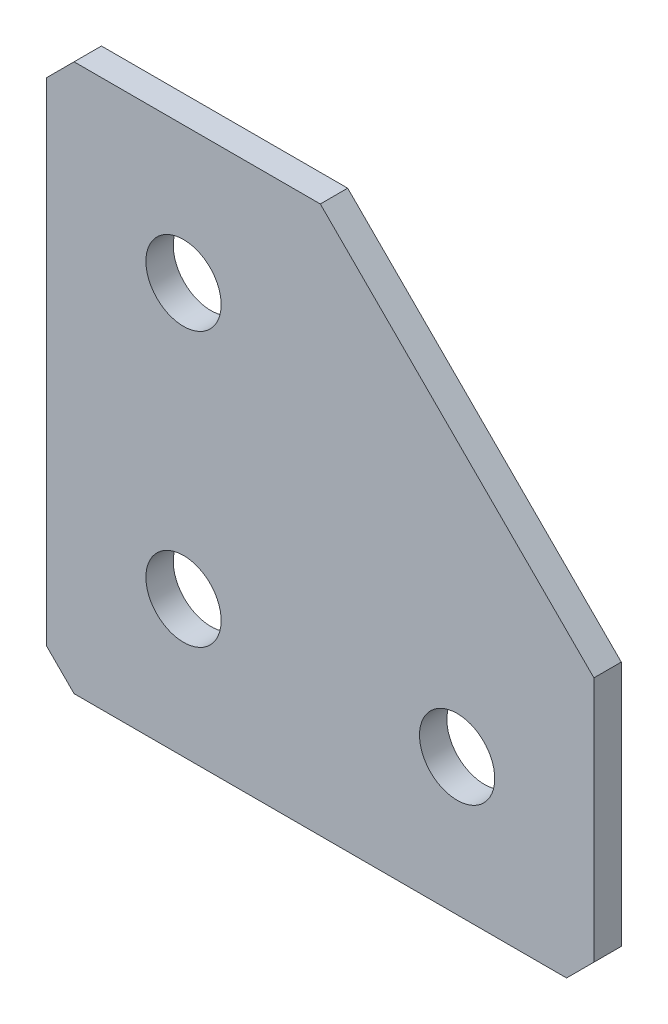
ISO-10303-21;
HEADER;
FILE_DESCRIPTION(('STEP AP214'),'2;1');
FILE_NAME('part.step','',(''),(''),'','','');
FILE_SCHEMA(('AUTOMOTIVE_DESIGN { 1 0 10303 214 1 1 1 1 }'));
ENDSEC;
DATA;
#1=APPLICATION_CONTEXT('core data for automotive mechanical design processes');
#2=APPLICATION_PROTOCOL_DEFINITION('international standard','automotive_design',2000,#1);
#3=PRODUCT_CONTEXT('',#1,'mechanical');
#4=PRODUCT('Part','Part','',(#3));
#5=PRODUCT_RELATED_PRODUCT_CATEGORY('part','',(#4));
#6=PRODUCT_DEFINITION_FORMATION('','',#4);
#7=PRODUCT_DEFINITION_CONTEXT('part definition',#1,'design');
#8=PRODUCT_DEFINITION('design','',#6,#7);
#9=PRODUCT_DEFINITION_SHAPE('','',#8);
#10=(LENGTH_UNIT() NAMED_UNIT(*) SI_UNIT(.MILLI.,.METRE.));
#11=(NAMED_UNIT(*) PLANE_ANGLE_UNIT() SI_UNIT($,.RADIAN.));
#12=(NAMED_UNIT(*) SI_UNIT($,.STERADIAN.) SOLID_ANGLE_UNIT());
#13=UNCERTAINTY_MEASURE_WITH_UNIT(LENGTH_MEASURE(1.E-05),#10,'distance_accuracy_value','');
#14=(GEOMETRIC_REPRESENTATION_CONTEXT(3) GLOBAL_UNCERTAINTY_ASSIGNED_CONTEXT((#13)) GLOBAL_UNIT_ASSIGNED_CONTEXT((#10,
#11,#12)) REPRESENTATION_CONTEXT('',''));
#15=CARTESIAN_POINT('',(0.,0.,0.));
#16=DIRECTION('',(0.,0.,1.));
#17=DIRECTION('',(1.,0.,0.));
#18=AXIS2_PLACEMENT_3D('',#15,#16,#17);
#19=CARTESIAN_POINT('',(20.,0.,-2.));
#20=DIRECTION('',(0.,-1.,0.));
#21=DIRECTION('',(1.,0.,0.));
#22=AXIS2_PLACEMENT_3D('',#19,#20,#21);
#23=PLANE('',#22);
#24=DIRECTION('',(1.,0.,0.));
#25=VECTOR('',#24,1.);
#26=CARTESIAN_POINT('',(20.,0.,-2.));
#27=LINE('',#26,#25);
#28=CARTESIAN_POINT('',(2.,0.,-2.));
#29=VERTEX_POINT('',#28);
#30=CARTESIAN_POINT('',(20.,0.,-2.));
#31=VERTEX_POINT('',#30);
#32=EDGE_CURVE('E103',#29,#31,#27,.T.);
#33=ORIENTED_EDGE('',*,*,#32,.F.);
#34=DIRECTION('',(0.,0.,1.));
#35=VECTOR('',#34,1.);
#36=CARTESIAN_POINT('',(2.,0.,-2.));
#37=LINE('',#36,#35);
#38=CARTESIAN_POINT('',(2.,0.,0.));
#39=VERTEX_POINT('',#38);
#40=EDGE_CURVE('E129',#29,#39,#37,.T.);
#41=ORIENTED_EDGE('',*,*,#40,.T.);
#42=DIRECTION('',(1.,0.,0.));
#43=VECTOR('',#42,1.);
#44=CARTESIAN_POINT('',(20.,0.,0.));
#45=LINE('',#44,#43);
#46=CARTESIAN_POINT('',(20.,0.,0.));
#47=VERTEX_POINT('',#46);
#48=EDGE_CURVE('E127',#39,#47,#45,.T.);
#49=ORIENTED_EDGE('',*,*,#48,.T.);
#50=DIRECTION('',(0.,0.,1.));
#51=VECTOR('',#50,1.);
#52=CARTESIAN_POINT('',(20.,0.,-2.));
#53=LINE('',#52,#51);
#54=EDGE_CURVE('E120',#31,#47,#53,.T.);
#55=ORIENTED_EDGE('',*,*,#54,.F.);
#56=EDGE_LOOP('',(#33,#41,#49,#55));
#57=FACE_BOUND('',#56,.T.);
#58=ADVANCED_FACE('F39',(#57),#23,.F.);
#59=CARTESIAN_POINT('',(40.,-20.,-2.));
#60=DIRECTION('',(-0.707106781186548,-0.707106781186547,0.));
#61=DIRECTION('',(0.707106781186547,-0.707106781186548,0.));
#62=AXIS2_PLACEMENT_3D('',#59,#60,#61);
#63=PLANE('',#62);
#64=DIRECTION('',(0.707106781186547,-0.707106781186548,0.));
#65=VECTOR('',#64,1.);
#66=CARTESIAN_POINT('',(40.,-20.,0.));
#67=LINE('',#66,#65);
#68=CARTESIAN_POINT('',(40.,-20.,0.));
#69=VERTEX_POINT('',#68);
#70=EDGE_CURVE('E166',#47,#69,#67,.T.);
#71=ORIENTED_EDGE('',*,*,#70,.T.);
#72=DIRECTION('',(0.,0.,1.));
#73=VECTOR('',#72,1.);
#74=CARTESIAN_POINT('',(40.,-20.,-2.));
#75=LINE('',#74,#73);
#76=CARTESIAN_POINT('',(40.,-20.,-2.));
#77=VERTEX_POINT('',#76);
#78=EDGE_CURVE('E122',#77,#69,#75,.T.);
#79=ORIENTED_EDGE('',*,*,#78,.F.);
#80=DIRECTION('',(0.707106781186547,-0.707106781186548,0.));
#81=VECTOR('',#80,1.);
#82=CARTESIAN_POINT('',(40.,-20.,-2.));
#83=LINE('',#82,#81);
#84=EDGE_CURVE('E107',#31,#77,#83,.T.);
#85=ORIENTED_EDGE('',*,*,#84,.F.);
#86=ORIENTED_EDGE('',*,*,#54,.T.);
#87=EDGE_LOOP('',(#71,#79,#85,#86));
#88=FACE_BOUND('',#87,.T.);
#89=ADVANCED_FACE('F119',(#88),#63,.F.);
#90=CARTESIAN_POINT('',(40.,-40.,-2.));
#91=DIRECTION('',(-1.,0.,0.));
#92=DIRECTION('',(0.,0.,1.));
#93=AXIS2_PLACEMENT_3D('',#90,#91,#92);
#94=PLANE('',#93);
#95=DIRECTION('',(0.,-1.,0.));
#96=VECTOR('',#95,1.);
#97=CARTESIAN_POINT('',(40.,-40.,0.));
#98=LINE('',#97,#96);
#99=CARTESIAN_POINT('',(40.,-38.,0.));
#100=VERTEX_POINT('',#99);
#101=EDGE_CURVE('E163',#69,#100,#98,.T.);
#102=ORIENTED_EDGE('',*,*,#101,.T.);
#103=DIRECTION('',(0.,0.,-1.));
#104=VECTOR('',#103,1.);
#105=CARTESIAN_POINT('',(40.,-38.,-2.));
#106=LINE('',#105,#104);
#107=CARTESIAN_POINT('',(40.,-38.,-2.));
#108=VERTEX_POINT('',#107);
#109=EDGE_CURVE('E12',#100,#108,#106,.T.);
#110=ORIENTED_EDGE('',*,*,#109,.T.);
#111=DIRECTION('',(0.,-1.,0.));
#112=VECTOR('',#111,1.);
#113=CARTESIAN_POINT('',(40.,-40.,-2.));
#114=LINE('',#113,#112);
#115=EDGE_CURVE('E124',#77,#108,#114,.T.);
#116=ORIENTED_EDGE('',*,*,#115,.F.);
#117=ORIENTED_EDGE('',*,*,#78,.T.);
#118=EDGE_LOOP('',(#102,#110,#116,#117));
#119=FACE_BOUND('',#118,.T.);
#120=ADVANCED_FACE('F184',(#119),#94,.F.);
#121=CARTESIAN_POINT('',(0.,-40.,-2.));
#122=DIRECTION('',(0.,1.,0.));
#123=DIRECTION('',(0.,0.,1.));
#124=AXIS2_PLACEMENT_3D('',#121,#122,#123);
#125=PLANE('',#124);
#126=DIRECTION('',(-1.,0.,0.));
#127=VECTOR('',#126,1.);
#128=CARTESIAN_POINT('',(0.,-40.,-2.));
#129=LINE('',#128,#127);
#130=CARTESIAN_POINT('',(38.,-40.,-2.));
#131=VERTEX_POINT('',#130);
#132=CARTESIAN_POINT('',(2.,-40.,-2.));
#133=VERTEX_POINT('',#132);
#134=EDGE_CURVE('E156',#131,#133,#129,.T.);
#135=ORIENTED_EDGE('',*,*,#134,.F.);
#136=DIRECTION('',(0.,0.,1.));
#137=VECTOR('',#136,1.);
#138=CARTESIAN_POINT('',(38.,-40.,-2.));
#139=LINE('',#138,#137);
#140=CARTESIAN_POINT('',(38.,-40.,0.));
#141=VERTEX_POINT('',#140);
#142=EDGE_CURVE('E47',#131,#141,#139,.T.);
#143=ORIENTED_EDGE('',*,*,#142,.T.);
#144=DIRECTION('',(-1.,0.,0.));
#145=VECTOR('',#144,1.);
#146=CARTESIAN_POINT('',(0.,-40.,0.));
#147=LINE('',#146,#145);
#148=CARTESIAN_POINT('',(2.,-40.,0.));
#149=VERTEX_POINT('',#148);
#150=EDGE_CURVE('E155',#141,#149,#147,.T.);
#151=ORIENTED_EDGE('',*,*,#150,.T.);
#152=DIRECTION('',(0.,0.,-1.));
#153=VECTOR('',#152,1.);
#154=CARTESIAN_POINT('',(2.,-40.,-2.));
#155=LINE('',#154,#153);
#156=EDGE_CURVE('E54',#149,#133,#155,.T.);
#157=ORIENTED_EDGE('',*,*,#156,.T.);
#158=EDGE_LOOP('',(#135,#143,#151,#157));
#159=FACE_BOUND('',#158,.T.);
#160=ADVANCED_FACE('F154',(#159),#125,.F.);
#161=CARTESIAN_POINT('',(0.,0.,-2.));
#162=DIRECTION('',(1.,0.,0.));
#163=DIRECTION('',(0.,0.,-1.));
#164=AXIS2_PLACEMENT_3D('',#161,#162,#163);
#165=PLANE('',#164);
#166=DIRECTION('',(0.,1.,0.));
#167=VECTOR('',#166,1.);
#168=CARTESIAN_POINT('',(0.,0.,0.));
#169=LINE('',#168,#167);
#170=CARTESIAN_POINT('',(0.,-38.,0.));
#171=VERTEX_POINT('',#170);
#172=CARTESIAN_POINT('',(0.,-2.00000000000001,0.));
#173=VERTEX_POINT('',#172);
#174=EDGE_CURVE('E115',#171,#173,#169,.T.);
#175=ORIENTED_EDGE('',*,*,#174,.T.);
#176=DIRECTION('',(0.,0.,-1.));
#177=VECTOR('',#176,1.);
#178=CARTESIAN_POINT('',(0.,-2.00000000000001,-2.));
#179=LINE('',#178,#177);
#180=CARTESIAN_POINT('',(0.,-2.00000000000001,-2.));
#181=VERTEX_POINT('',#180);
#182=EDGE_CURVE('E145',#173,#181,#179,.T.);
#183=ORIENTED_EDGE('',*,*,#182,.T.);
#184=DIRECTION('',(0.,1.,0.));
#185=VECTOR('',#184,1.);
#186=CARTESIAN_POINT('',(0.,0.,-2.));
#187=LINE('',#186,#185);
#188=CARTESIAN_POINT('',(0.,-38.,-2.));
#189=VERTEX_POINT('',#188);
#190=EDGE_CURVE('E133',#189,#181,#187,.T.);
#191=ORIENTED_EDGE('',*,*,#190,.F.);
#192=DIRECTION('',(0.,0.,1.));
#193=VECTOR('',#192,1.);
#194=CARTESIAN_POINT('',(0.,-38.,-2.));
#195=LINE('',#194,#193);
#196=EDGE_CURVE('E142',#189,#171,#195,.T.);
#197=ORIENTED_EDGE('',*,*,#196,.T.);
#198=EDGE_LOOP('',(#175,#183,#191,#197));
#199=FACE_BOUND('',#198,.T.);
#200=ADVANCED_FACE('F212',(#199),#165,.F.);
#201=CARTESIAN_POINT('',(0.,0.,-2.));
#202=DIRECTION('',(0.,0.,1.));
#203=DIRECTION('',(1.,0.,0.));
#204=AXIS2_PLACEMENT_3D('',#201,#202,#203);
#205=PLANE('',#204);
#206=CARTESIAN_POINT('',(10.,-30.,-2.));
#207=DIRECTION('',(0.,0.,-1.));
#208=DIRECTION('',(0.,1.,0.));
#209=AXIS2_PLACEMENT_3D('',#206,#207,#208);
#210=CIRCLE('',#209,2.75);
#211=CARTESIAN_POINT('',(10.,-27.25,-2.));
#212=VERTEX_POINT('',#211);
#213=EDGE_CURVE('E204',#212,#212,#210,.T.);
#214=ORIENTED_EDGE('',*,*,#213,.F.);
#215=EDGE_LOOP('',(#214));
#216=FACE_BOUND('',#215,.T.);
#217=CARTESIAN_POINT('',(10.,-9.99999999999999,-2.));
#218=DIRECTION('',(0.,0.,-1.));
#219=DIRECTION('',(0.,1.,0.));
#220=AXIS2_PLACEMENT_3D('',#217,#218,#219);
#221=CIRCLE('',#220,2.75);
#222=CARTESIAN_POINT('',(10.,-7.24999999999999,-2.));
#223=VERTEX_POINT('',#222);
#224=EDGE_CURVE('E197',#223,#223,#221,.T.);
#225=ORIENTED_EDGE('',*,*,#224,.F.);
#226=EDGE_LOOP('',(#225));
#227=FACE_BOUND('',#226,.T.);
#228=CARTESIAN_POINT('',(30.,-30.,-2.));
#229=DIRECTION('',(0.,0.,-1.));
#230=DIRECTION('',(0.,1.,0.));
#231=AXIS2_PLACEMENT_3D('',#228,#229,#230);
#232=CIRCLE('',#231,2.75);
#233=CARTESIAN_POINT('',(30.,-27.25,-2.));
#234=VERTEX_POINT('',#233);
#235=EDGE_CURVE('E190',#234,#234,#232,.T.);
#236=ORIENTED_EDGE('',*,*,#235,.F.);
#237=EDGE_LOOP('',(#236));
#238=FACE_BOUND('',#237,.T.);
#239=ORIENTED_EDGE('',*,*,#190,.T.);
#240=DIRECTION('',(-0.707106781186546,-0.707106781186549,0.));
#241=VECTOR('',#240,1.);
#242=CARTESIAN_POINT('',(2.,0.,-2.));
#243=LINE('',#242,#241);
#244=EDGE_CURVE('E110',#181,#29,#243,.F.);
#245=ORIENTED_EDGE('',*,*,#244,.T.);
#246=ORIENTED_EDGE('',*,*,#32,.T.);
#247=ORIENTED_EDGE('',*,*,#84,.T.);
#248=ORIENTED_EDGE('',*,*,#115,.T.);
#249=DIRECTION('',(0.707106781186546,0.707106781186549,0.));
#250=VECTOR('',#249,1.);
#251=CARTESIAN_POINT('',(38.,-40.,-2.));
#252=LINE('',#251,#250);
#253=EDGE_CURVE('E61',#108,#131,#252,.F.);
#254=ORIENTED_EDGE('',*,*,#253,.T.);
#255=ORIENTED_EDGE('',*,*,#134,.T.);
#256=DIRECTION('',(0.707106781186549,-0.707106781186546,0.));
#257=VECTOR('',#256,1.);
#258=CARTESIAN_POINT('',(0.,-38.,-2.));
#259=LINE('',#258,#257);
#260=EDGE_CURVE('E147',#133,#189,#259,.F.);
#261=ORIENTED_EDGE('',*,*,#260,.T.);
#262=EDGE_LOOP('',(#239,#245,#246,#247,#248,#254,#255,#261));
#263=FACE_BOUND('',#262,.T.);
#264=ADVANCED_FACE('F106',(#216,#227,#238,#263),#205,.F.);
#265=CARTESIAN_POINT('',(0.,0.,0.));
#266=DIRECTION('',(0.,0.,1.));
#267=DIRECTION('',(1.,0.,0.));
#268=AXIS2_PLACEMENT_3D('',#265,#266,#267);
#269=PLANE('',#268);
#270=CARTESIAN_POINT('',(10.,-30.,0.));
#271=DIRECTION('',(0.,0.,-1.));
#272=DIRECTION('',(0.,1.,0.));
#273=AXIS2_PLACEMENT_3D('',#270,#271,#272);
#274=CIRCLE('',#273,2.75);
#275=CARTESIAN_POINT('',(10.,-27.25,0.));
#276=VERTEX_POINT('',#275);
#277=EDGE_CURVE('E200',#276,#276,#274,.T.);
#278=ORIENTED_EDGE('',*,*,#277,.T.);
#279=EDGE_LOOP('',(#278));
#280=FACE_BOUND('',#279,.T.);
#281=CARTESIAN_POINT('',(10.,-9.99999999999999,0.));
#282=DIRECTION('',(0.,0.,-1.));
#283=DIRECTION('',(0.,1.,0.));
#284=AXIS2_PLACEMENT_3D('',#281,#282,#283);
#285=CIRCLE('',#284,2.75);
#286=CARTESIAN_POINT('',(10.,-7.25,0.));
#287=VERTEX_POINT('',#286);
#288=EDGE_CURVE('E193',#287,#287,#285,.T.);
#289=ORIENTED_EDGE('',*,*,#288,.T.);
#290=EDGE_LOOP('',(#289));
#291=FACE_BOUND('',#290,.T.);
#292=CARTESIAN_POINT('',(30.,-30.,0.));
#293=DIRECTION('',(0.,0.,-1.));
#294=DIRECTION('',(0.,1.,0.));
#295=AXIS2_PLACEMENT_3D('',#292,#293,#294);
#296=CIRCLE('',#295,2.75);
#297=CARTESIAN_POINT('',(30.,-27.25,0.));
#298=VERTEX_POINT('',#297);
#299=EDGE_CURVE('E180',#298,#298,#296,.T.);
#300=ORIENTED_EDGE('',*,*,#299,.T.);
#301=EDGE_LOOP('',(#300));
#302=FACE_BOUND('',#301,.T.);
#303=ORIENTED_EDGE('',*,*,#48,.F.);
#304=DIRECTION('',(0.707106781186546,0.707106781186549,0.));
#305=VECTOR('',#304,1.);
#306=CARTESIAN_POINT('',(1.,-1.,0.));
#307=LINE('',#306,#305);
#308=EDGE_CURVE('E140',#39,#173,#307,.F.);
#309=ORIENTED_EDGE('',*,*,#308,.T.);
#310=ORIENTED_EDGE('',*,*,#174,.F.);
#311=DIRECTION('',(-0.707106781186549,0.707106781186546,0.));
#312=VECTOR('',#311,1.);
#313=CARTESIAN_POINT('',(-19.,-19.0000000000001,0.));
#314=LINE('',#313,#312);
#315=EDGE_CURVE('E131',#171,#149,#314,.F.);
#316=ORIENTED_EDGE('',*,*,#315,.T.);
#317=ORIENTED_EDGE('',*,*,#150,.F.);
#318=DIRECTION('',(-0.707106781186546,-0.707106781186549,0.));
#319=VECTOR('',#318,1.);
#320=CARTESIAN_POINT('',(39.0000000000001,-38.9999999999999,0.));
#321=LINE('',#320,#319);
#322=EDGE_CURVE('E138',#141,#100,#321,.F.);
#323=ORIENTED_EDGE('',*,*,#322,.T.);
#324=ORIENTED_EDGE('',*,*,#101,.F.);
#325=ORIENTED_EDGE('',*,*,#70,.F.);
#326=EDGE_LOOP('',(#303,#309,#310,#316,#317,#323,#324,#325));
#327=FACE_BOUND('',#326,.T.);
#328=ADVANCED_FACE('F159',(#280,#291,#302,#327),#269,.T.);
#329=CARTESIAN_POINT('',(30.,-30.,-2.));
#330=DIRECTION('',(0.,0.,-1.));
#331=DIRECTION('',(0.,1.,0.));
#332=AXIS2_PLACEMENT_3D('',#329,#330,#331);
#333=CYLINDRICAL_SURFACE('',#332,2.75);
#334=ORIENTED_EDGE('',*,*,#299,.F.);
#335=EDGE_LOOP('',(#334));
#336=FACE_BOUND('',#335,.T.);
#337=ORIENTED_EDGE('',*,*,#235,.T.);
#338=EDGE_LOOP('',(#337));
#339=FACE_BOUND('',#338,.T.);
#340=ADVANCED_FACE('F219',(#336,#339),#333,.F.);
#341=CARTESIAN_POINT('',(10.,-9.99999999999999,-2.));
#342=DIRECTION('',(0.,0.,-1.));
#343=DIRECTION('',(0.,1.,0.));
#344=AXIS2_PLACEMENT_3D('',#341,#342,#343);
#345=CYLINDRICAL_SURFACE('',#344,2.75);
#346=ORIENTED_EDGE('',*,*,#288,.F.);
#347=EDGE_LOOP('',(#346));
#348=FACE_BOUND('',#347,.T.);
#349=ORIENTED_EDGE('',*,*,#224,.T.);
#350=EDGE_LOOP('',(#349));
#351=FACE_BOUND('',#350,.T.);
#352=ADVANCED_FACE('F221',(#348,#351),#345,.F.);
#353=CARTESIAN_POINT('',(10.,-30.,-2.));
#354=DIRECTION('',(0.,0.,-1.));
#355=DIRECTION('',(0.,1.,0.));
#356=AXIS2_PLACEMENT_3D('',#353,#354,#355);
#357=CYLINDRICAL_SURFACE('',#356,2.75);
#358=ORIENTED_EDGE('',*,*,#277,.F.);
#359=EDGE_LOOP('',(#358));
#360=FACE_BOUND('',#359,.T.);
#361=ORIENTED_EDGE('',*,*,#213,.T.);
#362=EDGE_LOOP('',(#361));
#363=FACE_BOUND('',#362,.T.);
#364=ADVANCED_FACE('F208',(#360,#363),#357,.F.);
#365=CARTESIAN_POINT('',(2.,0.,-2.));
#366=DIRECTION('',(0.707106781186549,-0.707106781186546,0.));
#367=DIRECTION('',(0.,0.,1.));
#368=AXIS2_PLACEMENT_3D('',#365,#366,#367);
#369=PLANE('',#368);
#370=ORIENTED_EDGE('',*,*,#244,.F.);
#371=ORIENTED_EDGE('',*,*,#182,.F.);
#372=ORIENTED_EDGE('',*,*,#308,.F.);
#373=ORIENTED_EDGE('',*,*,#40,.F.);
#374=EDGE_LOOP('',(#370,#371,#372,#373));
#375=FACE_BOUND('',#374,.T.);
#376=ADVANCED_FACE('F241',(#375),#369,.F.);
#377=CARTESIAN_POINT('',(38.,-40.,-2.));
#378=DIRECTION('',(-0.707106781186549,0.707106781186546,0.));
#379=DIRECTION('',(0.,0.,1.));
#380=AXIS2_PLACEMENT_3D('',#377,#378,#379);
#381=PLANE('',#380);
#382=ORIENTED_EDGE('',*,*,#253,.F.);
#383=ORIENTED_EDGE('',*,*,#109,.F.);
#384=ORIENTED_EDGE('',*,*,#322,.F.);
#385=ORIENTED_EDGE('',*,*,#142,.F.);
#386=EDGE_LOOP('',(#382,#383,#384,#385));
#387=FACE_BOUND('',#386,.T.);
#388=ADVANCED_FACE('F243',(#387),#381,.F.);
#389=CARTESIAN_POINT('',(0.,-38.,-2.));
#390=DIRECTION('',(0.707106781186546,0.707106781186549,0.));
#391=DIRECTION('',(0.,0.,1.));
#392=AXIS2_PLACEMENT_3D('',#389,#390,#391);
#393=PLANE('',#392);
#394=ORIENTED_EDGE('',*,*,#260,.F.);
#395=ORIENTED_EDGE('',*,*,#156,.F.);
#396=ORIENTED_EDGE('',*,*,#315,.F.);
#397=ORIENTED_EDGE('',*,*,#196,.F.);
#398=EDGE_LOOP('',(#394,#395,#396,#397));
#399=FACE_BOUND('',#398,.T.);
#400=ADVANCED_FACE('F41',(#399),#393,.F.);
#401=CLOSED_SHELL('',(#58,#89,#120,#160,#200,#264,#328,#340,#352,#364,#376,#388,#400));
#402=MANIFOLD_SOLID_BREP('B2',#401);
#403=ADVANCED_BREP_SHAPE_REPRESENTATION('',(#18,#402),#14);
#404=SHAPE_DEFINITION_REPRESENTATION(#9,#403);
ENDSEC;
END-ISO-10303-21;
